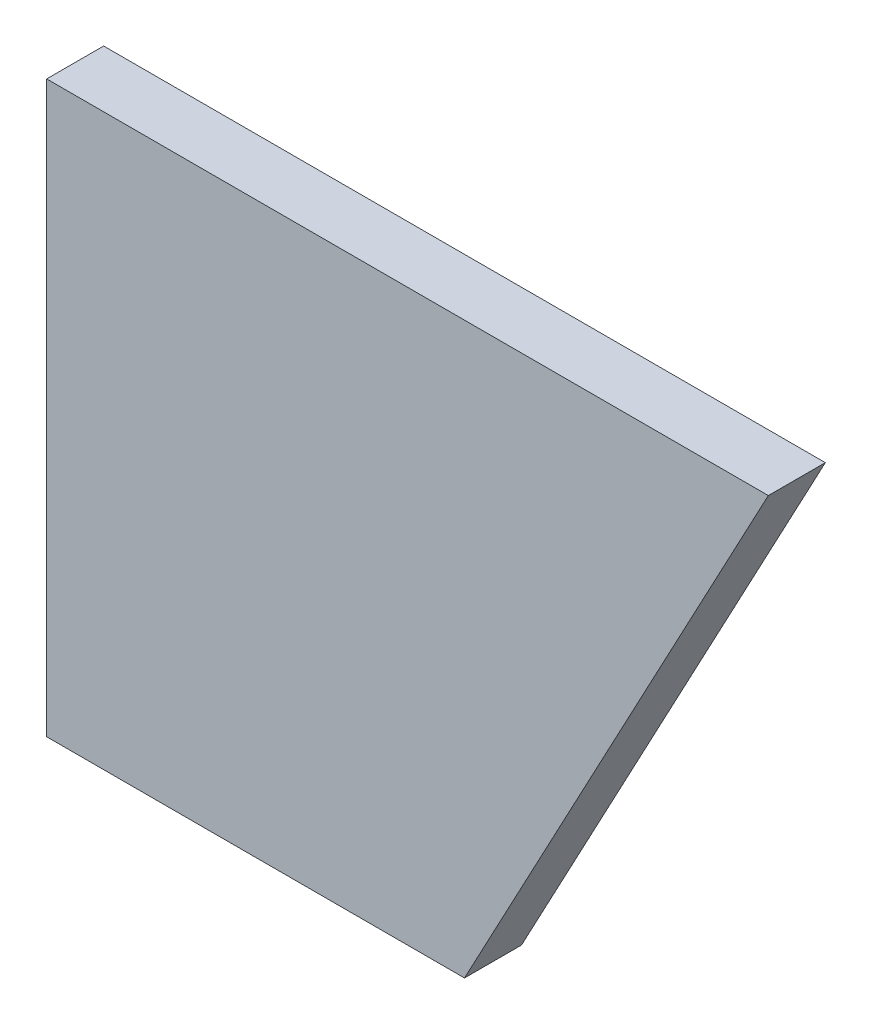
ISO-10303-21;
HEADER;
FILE_DESCRIPTION(('STEP AP214'),'2;1');
FILE_NAME('part.step','',(''),(''),'','','');
FILE_SCHEMA(('AUTOMOTIVE_DESIGN { 1 0 10303 214 1 1 1 1 }'));
ENDSEC;
DATA;
#1=APPLICATION_CONTEXT('core data for automotive mechanical design processes');
#2=APPLICATION_PROTOCOL_DEFINITION('international standard','automotive_design',2000,#1);
#3=PRODUCT_CONTEXT('',#1,'mechanical');
#4=PRODUCT('Part','Part','',(#3));
#5=PRODUCT_RELATED_PRODUCT_CATEGORY('part','',(#4));
#6=PRODUCT_DEFINITION_FORMATION('','',#4);
#7=PRODUCT_DEFINITION_CONTEXT('part definition',#1,'design');
#8=PRODUCT_DEFINITION('design','',#6,#7);
#9=PRODUCT_DEFINITION_SHAPE('','',#8);
#10=(LENGTH_UNIT() NAMED_UNIT(*) SI_UNIT(.MILLI.,.METRE.));
#11=(NAMED_UNIT(*) PLANE_ANGLE_UNIT() SI_UNIT($,.RADIAN.));
#12=(NAMED_UNIT(*) SI_UNIT($,.STERADIAN.) SOLID_ANGLE_UNIT());
#13=UNCERTAINTY_MEASURE_WITH_UNIT(LENGTH_MEASURE(1.E-05),#10,'distance_accuracy_value','');
#14=(GEOMETRIC_REPRESENTATION_CONTEXT(3) GLOBAL_UNCERTAINTY_ASSIGNED_CONTEXT((#13)) GLOBAL_UNIT_ASSIGNED_CONTEXT((#10,
#11,#12)) REPRESENTATION_CONTEXT('',''));
#15=CARTESIAN_POINT('',(0.,0.,0.));
#16=DIRECTION('',(0.,0.,1.));
#17=DIRECTION('',(1.,0.,0.));
#18=AXIS2_PLACEMENT_3D('',#15,#16,#17);
#19=CARTESIAN_POINT('',(0.,0.,3.));
#20=DIRECTION('',(1.,0.,0.));
#21=DIRECTION('',(0.,0.,-1.));
#22=AXIS2_PLACEMENT_3D('',#19,#20,#21);
#23=PLANE('',#22);
#24=DIRECTION('',(0.,-1.,0.));
#25=VECTOR('',#24,1.);
#26=CARTESIAN_POINT('',(0.,0.,0.));
#27=LINE('',#26,#25);
#28=CARTESIAN_POINT('',(0.,30.,0.));
#29=VERTEX_POINT('',#28);
#30=CARTESIAN_POINT('',(0.,0.,0.));
#31=VERTEX_POINT('',#30);
#32=EDGE_CURVE('E107',#29,#31,#27,.T.);
#33=ORIENTED_EDGE('',*,*,#32,.T.);
#34=DIRECTION('',(0.,0.,-1.));
#35=VECTOR('',#34,1.);
#36=CARTESIAN_POINT('',(0.,0.,3.));
#37=LINE('',#36,#35);
#38=CARTESIAN_POINT('',(0.,0.,3.));
#39=VERTEX_POINT('',#38);
#40=EDGE_CURVE('E11',#39,#31,#37,.T.);
#41=ORIENTED_EDGE('',*,*,#40,.F.);
#42=DIRECTION('',(0.,-1.,0.));
#43=VECTOR('',#42,1.);
#44=CARTESIAN_POINT('',(0.,0.,3.));
#45=LINE('',#44,#43);
#46=CARTESIAN_POINT('',(0.,30.,3.));
#47=VERTEX_POINT('',#46);
#48=EDGE_CURVE('E91',#47,#39,#45,.T.);
#49=ORIENTED_EDGE('',*,*,#48,.F.);
#50=DIRECTION('',(0.,0.,-1.));
#51=VECTOR('',#50,1.);
#52=CARTESIAN_POINT('',(0.,30.,3.));
#53=LINE('',#52,#51);
#54=EDGE_CURVE('E103',#47,#29,#53,.T.);
#55=ORIENTED_EDGE('',*,*,#54,.T.);
#56=EDGE_LOOP('',(#33,#41,#49,#55));
#57=FACE_BOUND('',#56,.T.);
#58=ADVANCED_FACE('F39',(#57),#23,.F.);
#59=CARTESIAN_POINT('',(0.,0.,3.));
#60=DIRECTION('',(0.,1.,0.));
#61=DIRECTION('',(0.,0.,1.));
#62=AXIS2_PLACEMENT_3D('',#59,#60,#61);
#63=PLANE('',#62);
#64=DIRECTION('',(1.,0.,0.));
#65=VECTOR('',#64,1.);
#66=CARTESIAN_POINT('',(0.,0.,0.));
#67=LINE('',#66,#65);
#68=CARTESIAN_POINT('',(22.,0.,0.));
#69=VERTEX_POINT('',#68);
#70=EDGE_CURVE('E96',#31,#69,#67,.T.);
#71=ORIENTED_EDGE('',*,*,#70,.T.);
#72=DIRECTION('',(0.,0.,-1.));
#73=VECTOR('',#72,1.);
#74=CARTESIAN_POINT('',(22.,0.,3.));
#75=LINE('',#74,#73);
#76=CARTESIAN_POINT('',(22.,0.,3.));
#77=VERTEX_POINT('',#76);
#78=EDGE_CURVE('E48',#77,#69,#75,.T.);
#79=ORIENTED_EDGE('',*,*,#78,.F.);
#80=DIRECTION('',(1.,0.,0.));
#81=VECTOR('',#80,1.);
#82=CARTESIAN_POINT('',(0.,0.,3.));
#83=LINE('',#82,#81);
#84=EDGE_CURVE('E86',#39,#77,#83,.T.);
#85=ORIENTED_EDGE('',*,*,#84,.F.);
#86=ORIENTED_EDGE('',*,*,#40,.T.);
#87=EDGE_LOOP('',(#71,#79,#85,#86));
#88=FACE_BOUND('',#87,.T.);
#89=ADVANCED_FACE('F95',(#88),#63,.F.);
#90=CARTESIAN_POINT('',(38.,30.,3.));
#91=DIRECTION('',(-0.88235294117647,0.470588235294118,0.));
#92=DIRECTION('',(-0.470588235294118,-0.882352941176471,0.));
#93=AXIS2_PLACEMENT_3D('',#90,#91,#92);
#94=PLANE('',#93);
#95=DIRECTION('',(0.470588235294118,0.882352941176471,0.));
#96=VECTOR('',#95,1.);
#97=CARTESIAN_POINT('',(38.,30.,0.));
#98=LINE('',#97,#96);
#99=CARTESIAN_POINT('',(38.,30.,0.));
#100=VERTEX_POINT('',#99);
#101=EDGE_CURVE('E73',#69,#100,#98,.T.);
#102=ORIENTED_EDGE('',*,*,#101,.T.);
#103=DIRECTION('',(0.,0.,-1.));
#104=VECTOR('',#103,1.);
#105=CARTESIAN_POINT('',(38.,30.,3.));
#106=LINE('',#105,#104);
#107=CARTESIAN_POINT('',(38.,30.,3.));
#108=VERTEX_POINT('',#107);
#109=EDGE_CURVE('E98',#108,#100,#106,.T.);
#110=ORIENTED_EDGE('',*,*,#109,.F.);
#111=DIRECTION('',(0.470588235294118,0.882352941176471,0.));
#112=VECTOR('',#111,1.);
#113=CARTESIAN_POINT('',(38.,30.,3.));
#114=LINE('',#113,#112);
#115=EDGE_CURVE('E89',#77,#108,#114,.T.);
#116=ORIENTED_EDGE('',*,*,#115,.F.);
#117=ORIENTED_EDGE('',*,*,#78,.T.);
#118=EDGE_LOOP('',(#102,#110,#116,#117));
#119=FACE_BOUND('',#118,.T.);
#120=ADVANCED_FACE('F99',(#119),#94,.F.);
#121=CARTESIAN_POINT('',(0.,30.,3.));
#122=DIRECTION('',(0.,-1.,0.));
#123=DIRECTION('',(0.,0.,-1.));
#124=AXIS2_PLACEMENT_3D('',#121,#122,#123);
#125=PLANE('',#124);
#126=DIRECTION('',(-1.,0.,0.));
#127=VECTOR('',#126,1.);
#128=CARTESIAN_POINT('',(0.,30.,0.));
#129=LINE('',#128,#127);
#130=EDGE_CURVE('E79',#100,#29,#129,.T.);
#131=ORIENTED_EDGE('',*,*,#130,.T.);
#132=ORIENTED_EDGE('',*,*,#54,.F.);
#133=DIRECTION('',(-1.,0.,0.));
#134=VECTOR('',#133,1.);
#135=CARTESIAN_POINT('',(0.,30.,3.));
#136=LINE('',#135,#134);
#137=EDGE_CURVE('E56',#108,#47,#136,.T.);
#138=ORIENTED_EDGE('',*,*,#137,.F.);
#139=ORIENTED_EDGE('',*,*,#109,.T.);
#140=EDGE_LOOP('',(#131,#132,#138,#139));
#141=FACE_BOUND('',#140,.T.);
#142=ADVANCED_FACE('F120',(#141),#125,.F.);
#143=CARTESIAN_POINT('',(0.,0.,3.));
#144=DIRECTION('',(0.,0.,-1.));
#145=DIRECTION('',(-1.,0.,0.));
#146=AXIS2_PLACEMENT_3D('',#143,#144,#145);
#147=PLANE('',#146);
#148=ORIENTED_EDGE('',*,*,#48,.T.);
#149=ORIENTED_EDGE('',*,*,#84,.T.);
#150=ORIENTED_EDGE('',*,*,#115,.T.);
#151=ORIENTED_EDGE('',*,*,#137,.T.);
#152=EDGE_LOOP('',(#148,#149,#150,#151));
#153=FACE_BOUND('',#152,.T.);
#154=ADVANCED_FACE('F87',(#153),#147,.F.);
#155=CARTESIAN_POINT('',(0.,0.,0.));
#156=DIRECTION('',(0.,0.,-1.));
#157=DIRECTION('',(-1.,0.,0.));
#158=AXIS2_PLACEMENT_3D('',#155,#156,#157);
#159=PLANE('',#158);
#160=ORIENTED_EDGE('',*,*,#32,.F.);
#161=ORIENTED_EDGE('',*,*,#130,.F.);
#162=ORIENTED_EDGE('',*,*,#101,.F.);
#163=ORIENTED_EDGE('',*,*,#70,.F.);
#164=EDGE_LOOP('',(#160,#161,#162,#163));
#165=FACE_BOUND('',#164,.T.);
#166=ADVANCED_FACE('F123',(#165),#159,.T.);
#167=CLOSED_SHELL('',(#58,#89,#120,#142,#154,#166));
#168=MANIFOLD_SOLID_BREP('B2',#167);
#169=ADVANCED_BREP_SHAPE_REPRESENTATION('',(#18,#168),#14);
#170=SHAPE_DEFINITION_REPRESENTATION(#9,#169);
ENDSEC;
END-ISO-10303-21;
